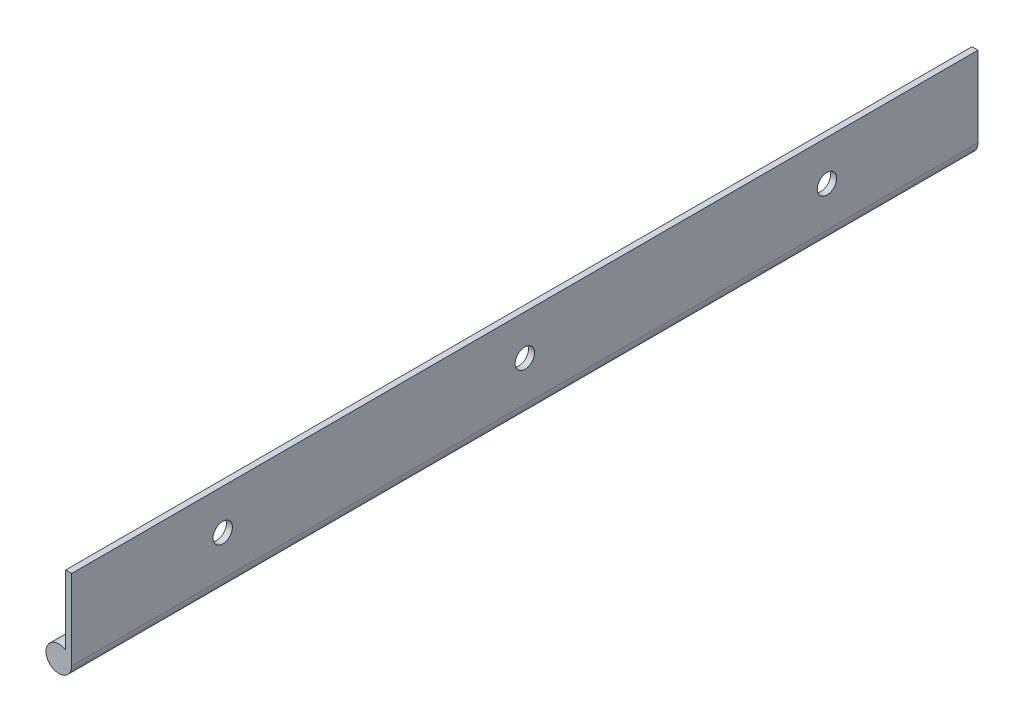
ISO-10303-21;
HEADER;
FILE_DESCRIPTION(('STEP AP214'),'2;1');
FILE_NAME('part.step','',(''),(''),'','','');
FILE_SCHEMA(('AUTOMOTIVE_DESIGN { 1 0 10303 214 1 1 1 1 }'));
ENDSEC;
DATA;
#1=APPLICATION_CONTEXT('core data for automotive mechanical design processes');
#2=APPLICATION_PROTOCOL_DEFINITION('international standard','automotive_design',2000,#1);
#3=PRODUCT_CONTEXT('',#1,'mechanical');
#4=PRODUCT('Part','Part','',(#3));
#5=PRODUCT_RELATED_PRODUCT_CATEGORY('part','',(#4));
#6=PRODUCT_DEFINITION_FORMATION('','',#4);
#7=PRODUCT_DEFINITION_CONTEXT('part definition',#1,'design');
#8=PRODUCT_DEFINITION('design','',#6,#7);
#9=PRODUCT_DEFINITION_SHAPE('','',#8);
#10=(LENGTH_UNIT() NAMED_UNIT(*) SI_UNIT(.MILLI.,.METRE.));
#11=(NAMED_UNIT(*) PLANE_ANGLE_UNIT() SI_UNIT($,.RADIAN.));
#12=(NAMED_UNIT(*) SI_UNIT($,.STERADIAN.) SOLID_ANGLE_UNIT());
#13=UNCERTAINTY_MEASURE_WITH_UNIT(LENGTH_MEASURE(1.E-05),#10,'distance_accuracy_value','');
#14=(GEOMETRIC_REPRESENTATION_CONTEXT(3) GLOBAL_UNCERTAINTY_ASSIGNED_CONTEXT((#13)) GLOBAL_UNIT_ASSIGNED_CONTEXT((#10,
#11,#12)) REPRESENTATION_CONTEXT('',''));
#15=CARTESIAN_POINT('',(0.,0.,0.));
#16=DIRECTION('',(0.,0.,1.));
#17=DIRECTION('',(1.,0.,0.));
#18=AXIS2_PLACEMENT_3D('',#15,#16,#17);
#19=CARTESIAN_POINT('',(0.507999999999999,-6.746875,152.4));
#20=DIRECTION('',(-1.,0.,0.));
#21=DIRECTION('',(0.,0.,1.));
#22=AXIS2_PLACEMENT_3D('',#19,#20,#21);
#23=PLANE('',#22);
#24=CARTESIAN_POINT('',(0.507999999999999,0.,25.4));
#25=DIRECTION('',(-1.,0.,0.));
#26=DIRECTION('',(0.,0.,1.));
#27=AXIS2_PLACEMENT_3D('',#24,#25,#26);
#28=CIRCLE('',#27,1.63194999999999);
#29=CARTESIAN_POINT('',(0.507999999999999,0.,27.03195));
#30=VERTEX_POINT('',#29);
#31=EDGE_CURVE('E120',#30,#30,#28,.T.);
#32=ORIENTED_EDGE('',*,*,#31,.T.);
#33=EDGE_LOOP('',(#32));
#34=FACE_BOUND('',#33,.T.);
#35=CARTESIAN_POINT('',(0.507999999999999,0.,76.2));
#36=DIRECTION('',(-1.,0.,0.));
#37=DIRECTION('',(0.,0.,1.));
#38=AXIS2_PLACEMENT_3D('',#35,#36,#37);
#39=CIRCLE('',#38,1.63194999999999);
#40=CARTESIAN_POINT('',(0.507999999999999,0.,77.83195));
#41=VERTEX_POINT('',#40);
#42=EDGE_CURVE('E114',#41,#41,#39,.T.);
#43=ORIENTED_EDGE('',*,*,#42,.T.);
#44=EDGE_LOOP('',(#43));
#45=FACE_BOUND('',#44,.T.);
#46=CARTESIAN_POINT('',(0.507999999999999,0.,127.));
#47=DIRECTION('',(-1.,0.,0.));
#48=DIRECTION('',(0.,0.,1.));
#49=AXIS2_PLACEMENT_3D('',#46,#47,#48);
#50=CIRCLE('',#49,1.63194999999999);
#51=CARTESIAN_POINT('',(0.507999999999999,0.,128.63195));
#52=VERTEX_POINT('',#51);
#53=EDGE_CURVE('E98',#52,#52,#50,.T.);
#54=ORIENTED_EDGE('',*,*,#53,.T.);
#55=EDGE_LOOP('',(#54));
#56=FACE_BOUND('',#55,.T.);
#57=DIRECTION('',(0.,1.,0.));
#58=VECTOR('',#57,1.);
#59=CARTESIAN_POINT('',(0.507999999999999,-6.746875,0.));
#60=LINE('',#59,#58);
#61=CARTESIAN_POINT('',(0.507999999999998,-6.746875,0.));
#62=VERTEX_POINT('',#61);
#63=CARTESIAN_POINT('',(0.507999999999999,6.746875,0.));
#64=VERTEX_POINT('',#63);
#65=EDGE_CURVE('E95',#62,#64,#60,.T.);
#66=ORIENTED_EDGE('',*,*,#65,.T.);
#67=DIRECTION('',(0.,0.,-1.));
#68=VECTOR('',#67,1.);
#69=CARTESIAN_POINT('',(0.507999999999999,6.746875,152.4));
#70=LINE('',#69,#68);
#71=CARTESIAN_POINT('',(0.507999999999999,6.746875,152.4));
#72=VERTEX_POINT('',#71);
#73=EDGE_CURVE('E11',#72,#64,#70,.T.);
#74=ORIENTED_EDGE('',*,*,#73,.F.);
#75=DIRECTION('',(0.,1.,0.));
#76=VECTOR('',#75,1.);
#77=CARTESIAN_POINT('',(0.507999999999999,-6.746875,152.4));
#78=LINE('',#77,#76);
#79=CARTESIAN_POINT('',(0.507999999999998,-6.746875,152.4));
#80=VERTEX_POINT('',#79);
#81=EDGE_CURVE('E83',#80,#72,#78,.T.);
#82=ORIENTED_EDGE('',*,*,#81,.F.);
#83=DIRECTION('',(0.,0.,-1.));
#84=VECTOR('',#83,1.);
#85=CARTESIAN_POINT('',(0.507999999999998,-6.746875,152.4));
#86=LINE('',#85,#84);
#87=EDGE_CURVE('E91',#80,#62,#86,.T.);
#88=ORIENTED_EDGE('',*,*,#87,.T.);
#89=EDGE_LOOP('',(#66,#74,#82,#88));
#90=FACE_BOUND('',#89,.T.);
#91=ADVANCED_FACE('F32',(#34,#45,#56,#90),#23,.F.);
#92=CARTESIAN_POINT('',(-0.508000000000001,6.746875,152.4));
#93=DIRECTION('',(0.,-1.,0.));
#94=DIRECTION('',(0.,0.,-1.));
#95=AXIS2_PLACEMENT_3D('',#92,#93,#94);
#96=PLANE('',#95);
#97=DIRECTION('',(-1.,0.,0.));
#98=VECTOR('',#97,1.);
#99=CARTESIAN_POINT('',(-0.508000000000001,6.746875,0.));
#100=LINE('',#99,#98);
#101=CARTESIAN_POINT('',(-0.508000000000001,6.746875,0.));
#102=VERTEX_POINT('',#101);
#103=EDGE_CURVE('E87',#64,#102,#100,.T.);
#104=ORIENTED_EDGE('',*,*,#103,.T.);
#105=DIRECTION('',(0.,0.,-1.));
#106=VECTOR('',#105,1.);
#107=CARTESIAN_POINT('',(-0.508000000000001,6.746875,152.4));
#108=LINE('',#107,#106);
#109=CARTESIAN_POINT('',(-0.508000000000001,6.746875,152.4));
#110=VERTEX_POINT('',#109);
#111=EDGE_CURVE('E40',#110,#102,#108,.T.);
#112=ORIENTED_EDGE('',*,*,#111,.F.);
#113=DIRECTION('',(-1.,0.,0.));
#114=VECTOR('',#113,1.);
#115=CARTESIAN_POINT('',(-0.508000000000001,6.746875,152.4));
#116=LINE('',#115,#114);
#117=EDGE_CURVE('E78',#72,#110,#116,.T.);
#118=ORIENTED_EDGE('',*,*,#117,.F.);
#119=ORIENTED_EDGE('',*,*,#73,.T.);
#120=EDGE_LOOP('',(#104,#112,#118,#119));
#121=FACE_BOUND('',#120,.T.);
#122=ADVANCED_FACE('F86',(#121),#96,.F.);
#123=CARTESIAN_POINT('',(-0.508000000000001,-4.91525495206429,152.4));
#124=DIRECTION('',(1.,0.,0.));
#125=DIRECTION('',(0.,0.,-1.));
#126=AXIS2_PLACEMENT_3D('',#123,#124,#125);
#127=PLANE('',#126);
#128=CARTESIAN_POINT('',(-0.508000000000002,0.,25.4));
#129=DIRECTION('',(-1.,0.,0.));
#130=DIRECTION('',(0.,0.,1.));
#131=AXIS2_PLACEMENT_3D('',#128,#129,#130);
#132=CIRCLE('',#131,1.63194999999999);
#133=CARTESIAN_POINT('',(-0.508000000000002,0.,27.03195));
#134=VERTEX_POINT('',#133);
#135=EDGE_CURVE('E123',#134,#134,#132,.T.);
#136=ORIENTED_EDGE('',*,*,#135,.F.);
#137=EDGE_LOOP('',(#136));
#138=FACE_BOUND('',#137,.T.);
#139=CARTESIAN_POINT('',(-0.508000000000002,0.,76.2));
#140=DIRECTION('',(-1.,0.,0.));
#141=DIRECTION('',(0.,0.,1.));
#142=AXIS2_PLACEMENT_3D('',#139,#140,#141);
#143=CIRCLE('',#142,1.63194999999999);
#144=CARTESIAN_POINT('',(-0.508000000000002,0.,77.83195));
#145=VERTEX_POINT('',#144);
#146=EDGE_CURVE('E117',#145,#145,#143,.T.);
#147=ORIENTED_EDGE('',*,*,#146,.F.);
#148=EDGE_LOOP('',(#147));
#149=FACE_BOUND('',#148,.T.);
#150=CARTESIAN_POINT('',(-0.508000000000002,0.,127.));
#151=DIRECTION('',(-1.,0.,0.));
#152=DIRECTION('',(0.,0.,1.));
#153=AXIS2_PLACEMENT_3D('',#150,#151,#152);
#154=CIRCLE('',#153,1.63194999999999);
#155=CARTESIAN_POINT('',(-0.508000000000002,0.,128.63195));
#156=VERTEX_POINT('',#155);
#157=EDGE_CURVE('E111',#156,#156,#154,.T.);
#158=ORIENTED_EDGE('',*,*,#157,.F.);
#159=EDGE_LOOP('',(#158));
#160=FACE_BOUND('',#159,.T.);
#161=DIRECTION('',(0.,-1.,0.));
#162=VECTOR('',#161,1.);
#163=CARTESIAN_POINT('',(-0.508000000000001,-4.91525495206429,0.));
#164=LINE('',#163,#162);
#165=CARTESIAN_POINT('',(-0.508000000000001,-4.91525495206429,0.));
#166=VERTEX_POINT('',#165);
#167=EDGE_CURVE('E65',#102,#166,#164,.T.);
#168=ORIENTED_EDGE('',*,*,#167,.T.);
#169=DIRECTION('',(0.,0.,-1.));
#170=VECTOR('',#169,1.);
#171=CARTESIAN_POINT('',(-0.508000000000001,-4.91525495206429,152.4));
#172=LINE('',#171,#170);
#173=CARTESIAN_POINT('',(-0.508000000000001,-4.91525495206429,152.4));
#174=VERTEX_POINT('',#173);
#175=EDGE_CURVE('E88',#174,#166,#172,.T.);
#176=ORIENTED_EDGE('',*,*,#175,.F.);
#177=DIRECTION('',(0.,-1.,0.));
#178=VECTOR('',#177,1.);
#179=CARTESIAN_POINT('',(-0.508000000000001,-4.91525495206429,152.4));
#180=LINE('',#179,#178);
#181=EDGE_CURVE('E81',#110,#174,#180,.T.);
#182=ORIENTED_EDGE('',*,*,#181,.F.);
#183=ORIENTED_EDGE('',*,*,#111,.T.);
#184=EDGE_LOOP('',(#168,#176,#182,#183));
#185=FACE_BOUND('',#184,.T.);
#186=ADVANCED_FACE('F89',(#138,#149,#160,#185),#127,.F.);
#187=CARTESIAN_POINT('',(-1.651,-6.746875,152.4));
#188=DIRECTION('',(0.,0.,-1.));
#189=DIRECTION('',(-1.,0.,0.));
#190=AXIS2_PLACEMENT_3D('',#187,#188,#189);
#191=CYLINDRICAL_SURFACE('',#190,2.159);
#192=CARTESIAN_POINT('',(-1.651,-6.746875,0.));
#193=DIRECTION('',(0.,0.,1.));
#194=DIRECTION('',(1.,0.,0.));
#195=AXIS2_PLACEMENT_3D('',#192,#193,#194);
#196=CIRCLE('',#195,2.159);
#197=EDGE_CURVE('E71',#166,#62,#196,.T.);
#198=ORIENTED_EDGE('',*,*,#197,.T.);
#199=ORIENTED_EDGE('',*,*,#87,.F.);
#200=CARTESIAN_POINT('',(-1.651,-6.746875,152.4));
#201=DIRECTION('',(0.,0.,1.));
#202=DIRECTION('',(1.,0.,0.));
#203=AXIS2_PLACEMENT_3D('',#200,#201,#202);
#204=CIRCLE('',#203,2.159);
#205=EDGE_CURVE('E48',#174,#80,#204,.T.);
#206=ORIENTED_EDGE('',*,*,#205,.F.);
#207=ORIENTED_EDGE('',*,*,#175,.T.);
#208=EDGE_LOOP('',(#198,#199,#206,#207));
#209=FACE_BOUND('',#208,.T.);
#210=ADVANCED_FACE('F103',(#209),#191,.T.);
#211=CARTESIAN_POINT('',(-1.651,-6.746875,152.4));
#212=DIRECTION('',(0.,0.,1.));
#213=DIRECTION('',(1.,0.,0.));
#214=AXIS2_PLACEMENT_3D('',#211,#212,#213);
#215=PLANE('',#214);
#216=ORIENTED_EDGE('',*,*,#81,.T.);
#217=ORIENTED_EDGE('',*,*,#117,.T.);
#218=ORIENTED_EDGE('',*,*,#181,.T.);
#219=ORIENTED_EDGE('',*,*,#205,.T.);
#220=EDGE_LOOP('',(#216,#217,#218,#219));
#221=FACE_BOUND('',#220,.T.);
#222=ADVANCED_FACE('F79',(#221),#215,.T.);
#223=CARTESIAN_POINT('',(-1.651,-6.746875,0.));
#224=DIRECTION('',(0.,0.,1.));
#225=DIRECTION('',(1.,0.,0.));
#226=AXIS2_PLACEMENT_3D('',#223,#224,#225);
#227=PLANE('',#226);
#228=ORIENTED_EDGE('',*,*,#65,.F.);
#229=ORIENTED_EDGE('',*,*,#197,.F.);
#230=ORIENTED_EDGE('',*,*,#167,.F.);
#231=ORIENTED_EDGE('',*,*,#103,.F.);
#232=EDGE_LOOP('',(#228,#229,#230,#231));
#233=FACE_BOUND('',#232,.T.);
#234=ADVANCED_FACE('F106',(#233),#227,.F.);
#235=CARTESIAN_POINT('',(-0.508000000000001,0.,127.));
#236=DIRECTION('',(-1.,0.,0.));
#237=DIRECTION('',(0.,0.,1.));
#238=AXIS2_PLACEMENT_3D('',#235,#236,#237);
#239=CYLINDRICAL_SURFACE('',#238,1.63194999999999);
#240=ORIENTED_EDGE('',*,*,#157,.T.);
#241=EDGE_LOOP('',(#240));
#242=FACE_BOUND('',#241,.T.);
#243=ORIENTED_EDGE('',*,*,#53,.F.);
#244=EDGE_LOOP('',(#243));
#245=FACE_BOUND('',#244,.T.);
#246=ADVANCED_FACE('F137',(#242,#245),#239,.F.);
#247=CARTESIAN_POINT('',(-0.508000000000001,0.,76.2));
#248=DIRECTION('',(-1.,0.,0.));
#249=DIRECTION('',(0.,0.,1.));
#250=AXIS2_PLACEMENT_3D('',#247,#248,#249);
#251=CYLINDRICAL_SURFACE('',#250,1.63194999999999);
#252=ORIENTED_EDGE('',*,*,#146,.T.);
#253=EDGE_LOOP('',(#252));
#254=FACE_BOUND('',#253,.T.);
#255=ORIENTED_EDGE('',*,*,#42,.F.);
#256=EDGE_LOOP('',(#255));
#257=FACE_BOUND('',#256,.T.);
#258=ADVANCED_FACE('F140',(#254,#257),#251,.F.);
#259=CARTESIAN_POINT('',(-0.508000000000001,0.,25.4));
#260=DIRECTION('',(-1.,0.,0.));
#261=DIRECTION('',(0.,0.,1.));
#262=AXIS2_PLACEMENT_3D('',#259,#260,#261);
#263=CYLINDRICAL_SURFACE('',#262,1.63194999999999);
#264=ORIENTED_EDGE('',*,*,#135,.T.);
#265=EDGE_LOOP('',(#264));
#266=FACE_BOUND('',#265,.T.);
#267=ORIENTED_EDGE('',*,*,#31,.F.);
#268=EDGE_LOOP('',(#267));
#269=FACE_BOUND('',#268,.T.);
#270=ADVANCED_FACE('F127',(#266,#269),#263,.F.);
#271=CLOSED_SHELL('',(#91,#122,#186,#210,#222,#234,#246,#258,#270));
#272=MANIFOLD_SOLID_BREP('B2',#271);
#273=ADVANCED_BREP_SHAPE_REPRESENTATION('',(#18,#272),#14);
#274=SHAPE_DEFINITION_REPRESENTATION(#9,#273);
ENDSEC;
END-ISO-10303-21;
